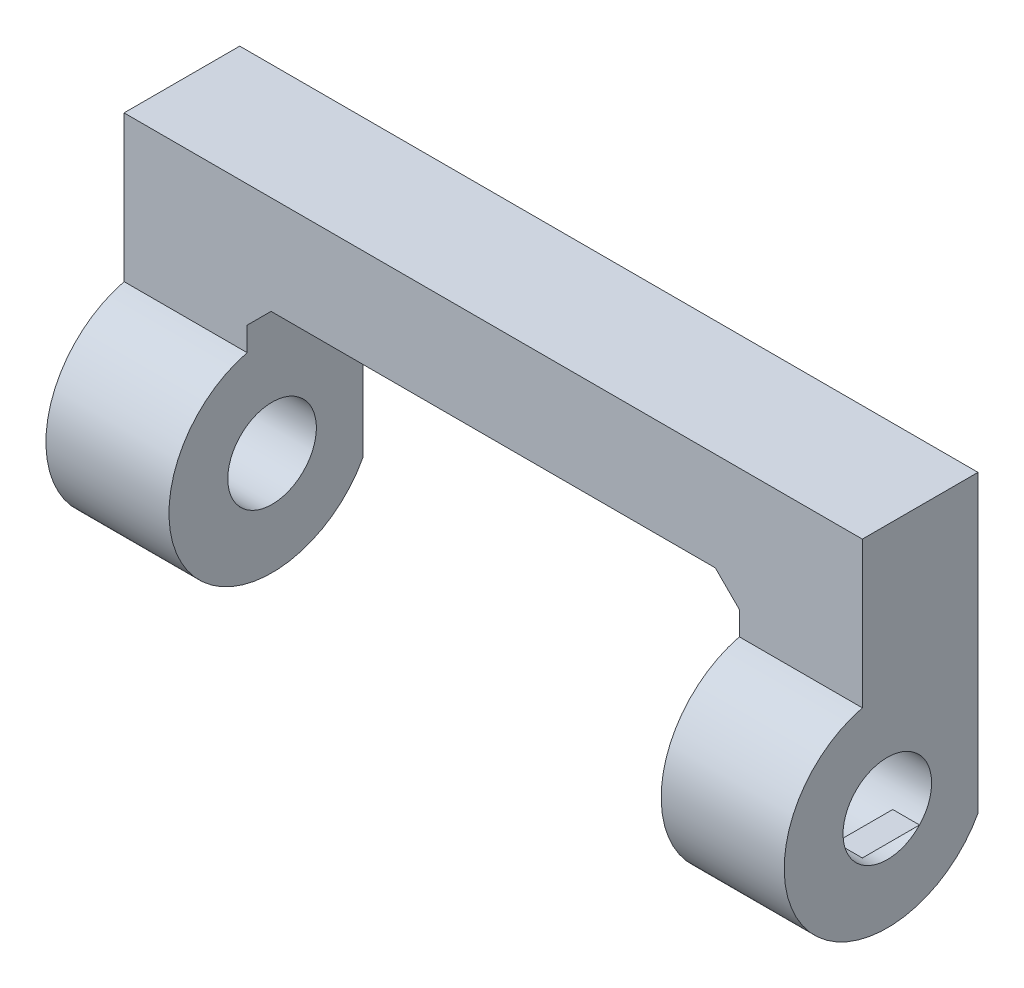
ISO-10303-21;
HEADER;
FILE_DESCRIPTION(('STEP AP214'),'2;1');
FILE_NAME('part.step','',(''),(''),'','','');
FILE_SCHEMA(('AUTOMOTIVE_DESIGN { 1 0 10303 214 1 1 1 1 }'));
ENDSEC;
DATA;
#1=APPLICATION_CONTEXT('core data for automotive mechanical design processes');
#2=APPLICATION_PROTOCOL_DEFINITION('international standard','automotive_design',2000,#1);
#3=PRODUCT_CONTEXT('',#1,'mechanical');
#4=PRODUCT('Part','Part','',(#3));
#5=PRODUCT_RELATED_PRODUCT_CATEGORY('part','',(#4));
#6=PRODUCT_DEFINITION_FORMATION('','',#4);
#7=PRODUCT_DEFINITION_CONTEXT('part definition',#1,'design');
#8=PRODUCT_DEFINITION('design','',#6,#7);
#9=PRODUCT_DEFINITION_SHAPE('','',#8);
#10=(LENGTH_UNIT() NAMED_UNIT(*) SI_UNIT(.MILLI.,.METRE.));
#11=(NAMED_UNIT(*) PLANE_ANGLE_UNIT() SI_UNIT($,.RADIAN.));
#12=(NAMED_UNIT(*) SI_UNIT($,.STERADIAN.) SOLID_ANGLE_UNIT());
#13=UNCERTAINTY_MEASURE_WITH_UNIT(LENGTH_MEASURE(1.E-05),#10,'distance_accuracy_value','');
#14=(GEOMETRIC_REPRESENTATION_CONTEXT(3) GLOBAL_UNCERTAINTY_ASSIGNED_CONTEXT((#13)) GLOBAL_UNIT_ASSIGNED_CONTEXT((#10,
#11,#12)) REPRESENTATION_CONTEXT('',''));
#15=CARTESIAN_POINT('',(0.,0.,0.));
#16=DIRECTION('',(0.,0.,1.));
#17=DIRECTION('',(1.,0.,0.));
#18=AXIS2_PLACEMENT_3D('',#15,#16,#17);
#19=CARTESIAN_POINT('',(0.00891092043960089,28.1178383359795,5.));
#20=DIRECTION('',(0.000316913408692528,0.999999949782944,0.));
#21=DIRECTION('',(-0.999999949782944,0.000316913408692528,0.));
#22=AXIS2_PLACEMENT_3D('',#19,#20,#21);
#23=PLANE('',#22);
#24=CARTESIAN_POINT('',(-3578.65020959207,29.2519634533622,3.98565749789785));
#25=DIRECTION('',(0.000316913408692528,0.999999949782944,0.));
#26=DIRECTION('',(-0.999999949782944,0.000316913408692528,0.));
#27=AXIS2_PLACEMENT_3D('',#24,#25,#26);
#28=ELLIPSE('',#27,5678.75808612486,1.7996745821636);
#29=CARTESIAN_POINT('',(319.6439887053,28.0165416888542,2.67700870408364));
#30=VERTEX_POINT('',#29);
#31=CARTESIAN_POINT('',(318.554795372569,28.0168868688433,2.67668375549989));
#32=VERTEX_POINT('',#31);
#33=EDGE_CURVE('E207',#30,#32,#28,.T.);
#34=ORIENTED_EDGE('',*,*,#33,.F.);
#35=DIRECTION('',(0.,0.,-1.));
#36=VECTOR('',#35,1.);
#37=CARTESIAN_POINT('',(319.6439887053,28.0165416888542,5.));
#38=LINE('',#37,#36);
#39=CARTESIAN_POINT('',(319.6439887053,28.0165416888542,5.));
#40=VERTEX_POINT('',#39);
#41=EDGE_CURVE('E240',#40,#30,#38,.T.);
#42=ORIENTED_EDGE('',*,*,#41,.F.);
#43=DIRECTION('',(0.999999949782944,-0.000316913408692528,0.));
#44=VECTOR('',#43,1.);
#45=CARTESIAN_POINT('',(0.00891092043960089,28.1178383359795,5.));
#46=LINE('',#45,#44);
#47=CARTESIAN_POINT('',(318.554795372563,28.0168868688433,5.));
#48=VERTEX_POINT('',#47);
#49=EDGE_CURVE('E212',#48,#40,#46,.T.);
#50=ORIENTED_EDGE('',*,*,#49,.F.);
#51=DIRECTION('',(0.,0.,-1.));
#52=VECTOR('',#51,1.);
#53=CARTESIAN_POINT('',(318.554795372569,28.0168868688433,5.));
#54=LINE('',#53,#52);
#55=EDGE_CURVE('E383',#48,#32,#54,.T.);
#56=ORIENTED_EDGE('',*,*,#55,.T.);
#57=EDGE_LOOP('',(#34,#42,#50,#56));
#58=FACE_BOUND('',#57,.T.);
#59=ADVANCED_FACE('F39',(#58),#23,.F.);
#60=CARTESIAN_POINT('',(0.,0.,5.));
#61=DIRECTION('',(0.,0.,1.));
#62=DIRECTION('',(1.,0.,0.));
#63=AXIS2_PLACEMENT_3D('',#60,#61,#62);
#64=PLANE('',#63);
#65=DIRECTION('',(-1.,0.,0.));
#66=VECTOR('',#65,1.);
#67=CARTESIAN_POINT('',(319.6439887053,28.0168868688433,5.));
#68=LINE('',#67,#66);
#69=CARTESIAN_POINT('',(319.6439887053,28.0168868688433,5.));
#70=VERTEX_POINT('',#69);
#71=EDGE_CURVE('E690',#70,#48,#68,.T.);
#72=ORIENTED_EDGE('',*,*,#71,.T.);
#73=ORIENTED_EDGE('',*,*,#49,.T.);
#74=DIRECTION('',(0.,-1.,0.));
#75=VECTOR('',#74,1.);
#76=CARTESIAN_POINT('',(319.6439887053,0.,5.));
#77=LINE('',#76,#75);
#78=EDGE_CURVE('E215',#70,#40,#77,.T.);
#79=ORIENTED_EDGE('',*,*,#78,.F.);
#80=EDGE_LOOP('',(#72,#73,#79));
#81=FACE_BOUND('',#80,.T.);
#82=ADVANCED_FACE('F428',(#81),#64,.T.);
#83=CARTESIAN_POINT('',(130.157955892487,-130.183347306878,5.));
#84=DIRECTION('',(-0.707037812810984,0.707175742835867,0.));
#85=DIRECTION('',(-0.707175742835867,-0.707037812810984,0.));
#86=AXIS2_PLACEMENT_3D('',#83,#84,#85);
#87=PLANE('',#86);
#88=DIRECTION('',(0.,0.,-1.));
#89=VECTOR('',#88,1.);
#90=CARTESIAN_POINT('',(294.639989597374,34.2666052481232,5.));
#91=LINE('',#90,#89);
#92=CARTESIAN_POINT('',(294.639989597374,34.2666052481232,5.));
#93=VERTEX_POINT('',#92);
#94=CARTESIAN_POINT('',(294.639989597374,34.2666052481232,0.300000000000019));
#95=VERTEX_POINT('',#94);
#96=EDGE_CURVE('E231',#93,#95,#91,.T.);
#97=ORIENTED_EDGE('',*,*,#96,.T.);
#98=DIRECTION('',(0.707175742835867,0.707037812810984,0.));
#99=VECTOR('',#98,1.);
#100=CARTESIAN_POINT('',(130.157955892487,-130.183347306878,0.300000000000025));
#101=LINE('',#100,#99);
#102=CARTESIAN_POINT('',(295.614474597472,35.240900181265,0.300000000000025));
#103=VERTEX_POINT('',#102);
#104=EDGE_CURVE('E282',#95,#103,#101,.T.);
#105=ORIENTED_EDGE('',*,*,#104,.T.);
#106=DIRECTION('',(0.,0.,-1.));
#107=VECTOR('',#106,1.);
#108=CARTESIAN_POINT('',(295.614474597472,35.240900181265,5.));
#109=LINE('',#108,#107);
#110=CARTESIAN_POINT('',(295.614474597472,35.240900181265,5.));
#111=VERTEX_POINT('',#110);
#112=EDGE_CURVE('E248',#111,#103,#109,.T.);
#113=ORIENTED_EDGE('',*,*,#112,.F.);
#114=DIRECTION('',(0.707175742835867,0.707037812810984,0.));
#115=VECTOR('',#114,1.);
#116=CARTESIAN_POINT('',(130.157955892487,-130.183347306878,5.));
#117=LINE('',#116,#115);
#118=EDGE_CURVE('E380',#93,#111,#117,.T.);
#119=ORIENTED_EDGE('',*,*,#118,.F.);
#120=EDGE_LOOP('',(#97,#105,#113,#119));
#121=FACE_BOUND('',#120,.T.);
#122=ADVANCED_FACE('F381',(#121),#87,.F.);
#123=CARTESIAN_POINT('',(0.00343618517108513,35.2697039001932,5.));
#124=DIRECTION('',(9.74259711536303E-05,0.99999999525409,0.));
#125=DIRECTION('',(-0.99999999525409,9.74259711536303E-05,0.));
#126=AXIS2_PLACEMENT_3D('',#123,#124,#125);
#127=PLANE('',#126);
#128=DIRECTION('',(0.99999999525409,-9.74259711536303E-05,0.));
#129=VECTOR('',#128,1.);
#130=CARTESIAN_POINT('',(0.00343618517108513,35.2697039001932,0.300000000000019));
#131=LINE('',#130,#129);
#132=CARTESIAN_POINT('',(304.640051212635,35.2400243819843,0.300000000000019));
#133=VERTEX_POINT('',#132);
#134=EDGE_CURVE('E278',#103,#133,#131,.T.);
#135=ORIENTED_EDGE('',*,*,#134,.T.);
#136=DIRECTION('',(0.99999999525409,-9.74259711536303E-05,0.));
#137=VECTOR('',#136,1.);
#138=CARTESIAN_POINT('',(0.00343618517108513,35.2697039001932,0.300000000000019));
#139=LINE('',#138,#137);
#140=CARTESIAN_POINT('',(313.667685024274,35.2391448559888,0.300000000000019));
#141=VERTEX_POINT('',#140);
#142=EDGE_CURVE('E280',#133,#141,#139,.T.);
#143=ORIENTED_EDGE('',*,*,#142,.T.);
#144=DIRECTION('',(0.,0.,-1.));
#145=VECTOR('',#144,1.);
#146=CARTESIAN_POINT('',(313.667685024274,35.2391448559888,5.));
#147=LINE('',#146,#145);
#148=CARTESIAN_POINT('',(313.667685024274,35.2391448559888,5.));
#149=VERTEX_POINT('',#148);
#150=EDGE_CURVE('E245',#149,#141,#147,.T.);
#151=ORIENTED_EDGE('',*,*,#150,.F.);
#152=DIRECTION('',(0.99999999525409,-9.74259711536303E-05,0.));
#153=VECTOR('',#152,1.);
#154=CARTESIAN_POINT('',(0.00343618517108513,35.2697039001932,5.));
#155=LINE('',#154,#153);
#156=CARTESIAN_POINT('',(304.640051212635,35.2400243819843,5.));
#157=VERTEX_POINT('',#156);
#158=EDGE_CURVE('E217',#157,#149,#155,.T.);
#159=ORIENTED_EDGE('',*,*,#158,.F.);
#160=DIRECTION('',(0.999999995292078,-9.70352714235132E-05,0.));
#161=VECTOR('',#160,1.);
#162=CARTESIAN_POINT('',(0.00342239375794619,35.2695848800865,5.));
#163=LINE('',#162,#161);
#164=EDGE_CURVE('E382',#111,#157,#163,.T.);
#165=ORIENTED_EDGE('',*,*,#164,.F.);
#166=ORIENTED_EDGE('',*,*,#112,.T.);
#167=EDGE_LOOP('',(#135,#143,#151,#159,#165,#166));
#168=FACE_BOUND('',#167,.T.);
#169=ADVANCED_FACE('F393',(#168),#127,.F.);
#170=CARTESIAN_POINT('',(174.160958512219,174.485995032664,5.));
#171=DIRECTION('',(-0.706447252798405,-0.707765694996294,0.));
#172=DIRECTION('',(0.707765694996294,-0.706447252798405,0.));
#173=AXIS2_PLACEMENT_3D('',#170,#171,#172);
#174=PLANE('',#173);
#175=ORIENTED_EDGE('',*,*,#150,.T.);
#176=DIRECTION('',(0.707765694996294,-0.706447252798405,0.));
#177=VECTOR('',#176,1.);
#178=CARTESIAN_POINT('',(314.6439887053,34.2646598558916,0.300000000000006));
#179=LINE('',#178,#177);
#180=CARTESIAN_POINT('',(314.6439887053,34.2646598558916,0.300000000000006));
#181=VERTEX_POINT('',#180);
#182=EDGE_CURVE('E276',#141,#181,#179,.T.);
#183=ORIENTED_EDGE('',*,*,#182,.T.);
#184=DIRECTION('',(0.,0.,-1.));
#185=VECTOR('',#184,1.);
#186=CARTESIAN_POINT('',(314.6439887053,34.2646598558916,5.));
#187=LINE('',#186,#185);
#188=CARTESIAN_POINT('',(314.6439887053,34.2646598558916,5.));
#189=VERTEX_POINT('',#188);
#190=EDGE_CURVE('E243',#189,#181,#187,.T.);
#191=ORIENTED_EDGE('',*,*,#190,.F.);
#192=DIRECTION('',(-0.707765694996294,0.706447252798405,0.));
#193=VECTOR('',#192,1.);
#194=CARTESIAN_POINT('',(174.160958512219,174.485995032664,5.));
#195=LINE('',#194,#193);
#196=EDGE_CURVE('E211',#189,#149,#195,.T.);
#197=ORIENTED_EDGE('',*,*,#196,.T.);
#198=EDGE_LOOP('',(#175,#183,#191,#197));
#199=FACE_BOUND('',#198,.T.);
#200=ADVANCED_FACE('F397',(#199),#174,.T.);
#201=CARTESIAN_POINT('',(314.643988705299,-2.7961508189543E-12,5.));
#202=DIRECTION('',(1.,0.,0.));
#203=DIRECTION('',(0.,1.,0.));
#204=AXIS2_PLACEMENT_3D('',#201,#202,#203);
#205=PLANE('',#204);
#206=ORIENTED_EDGE('',*,*,#190,.T.);
#207=DIRECTION('',(0.,-1.,0.));
#208=VECTOR('',#207,1.);
#209=CARTESIAN_POINT('',(314.643988705299,-2.7961508189543E-12,0.299999999999991));
#210=LINE('',#209,#208);
#211=CARTESIAN_POINT('',(314.6439887053,27.2420174168275,0.299999999999991));
#212=VERTEX_POINT('',#211);
#213=EDGE_CURVE('E193',#181,#212,#210,.T.);
#214=ORIENTED_EDGE('',*,*,#213,.T.);
#215=CARTESIAN_POINT('',(314.6439887053,29.2345980989651,3.98580689099696));
#216=DIRECTION('',(-1.,0.,0.));
#217=DIRECTION('',(0.,-1.,0.));
#218=AXIS2_PLACEMENT_3D('',#215,#216,#217);
#219=CIRCLE('',#218,4.18993439239193);
#220=CARTESIAN_POINT('',(314.6439887053,33.2999348070619,5.));
#221=VERTEX_POINT('',#220);
#222=EDGE_CURVE('E184',#212,#221,#219,.T.);
#223=ORIENTED_EDGE('',*,*,#222,.T.);
#224=DIRECTION('',(0.,-1.,0.));
#225=VECTOR('',#224,1.);
#226=CARTESIAN_POINT('',(314.643988705299,-2.7961508189543E-12,5.));
#227=LINE('',#226,#225);
#228=EDGE_CURVE('E190',#189,#221,#227,.T.);
#229=ORIENTED_EDGE('',*,*,#228,.F.);
#230=EDGE_LOOP('',(#206,#214,#223,#229));
#231=FACE_BOUND('',#230,.T.);
#232=CARTESIAN_POINT('',(314.6439887053,29.2519647947874,3.98565706253535));
#233=DIRECTION('',(1.,0.,0.));
#234=DIRECTION('',(0.,1.,0.));
#235=AXIS2_PLACEMENT_3D('',#232,#233,#234);
#236=CIRCLE('',#235,1.7996745821636);
#237=CARTESIAN_POINT('',(314.6439887053,31.051639376951,3.98565706253535));
#238=VERTEX_POINT('',#237);
#239=EDGE_CURVE('E387',#238,#238,#236,.T.);
#240=ORIENTED_EDGE('',*,*,#239,.T.);
#241=EDGE_LOOP('',(#240));
#242=FACE_BOUND('',#241,.T.);
#243=ADVANCED_FACE('F187',(#231,#242),#205,.F.);
#244=CARTESIAN_POINT('',(319.6439887053,0.,5.));
#245=DIRECTION('',(1.,0.,0.));
#246=DIRECTION('',(0.,0.,-1.));
#247=AXIS2_PLACEMENT_3D('',#244,#245,#246);
#248=PLANE('',#247);
#249=ORIENTED_EDGE('',*,*,#41,.T.);
#250=CARTESIAN_POINT('',(319.6439887053,29.2519647947874,3.98565706253535));
#251=DIRECTION('',(-1.,0.,0.));
#252=DIRECTION('',(0.,0.,1.));
#253=AXIS2_PLACEMENT_3D('',#250,#251,#252);
#254=CIRCLE('',#253,1.7996745821636);
#255=CARTESIAN_POINT('',(319.6439887053,28.0168868688433,2.67668375549989));
#256=VERTEX_POINT('',#255);
#257=EDGE_CURVE('E699',#30,#256,#254,.T.);
#258=ORIENTED_EDGE('',*,*,#257,.T.);
#259=DIRECTION('',(0.,0.,1.));
#260=VECTOR('',#259,1.);
#261=CARTESIAN_POINT('',(319.6439887053,28.0168868688433,0.));
#262=LINE('',#261,#260);
#263=EDGE_CURVE('E692',#256,#70,#262,.T.);
#264=ORIENTED_EDGE('',*,*,#263,.T.);
#265=ORIENTED_EDGE('',*,*,#78,.T.);
#266=EDGE_LOOP('',(#249,#258,#264,#265));
#267=FACE_BOUND('',#266,.T.);
#268=CARTESIAN_POINT('',(319.6439887053,29.234598098965,3.98580689099696));
#269=DIRECTION('',(-1.,0.,0.));
#270=DIRECTION('',(0.,-1.,0.));
#271=AXIS2_PLACEMENT_3D('',#268,#269,#270);
#272=CIRCLE('',#271,4.18993439239193);
#273=CARTESIAN_POINT('',(319.6439887053,27.2420174168274,0.300000000000005));
#274=VERTEX_POINT('',#273);
#275=CARTESIAN_POINT('',(319.6439887053,33.2999348070618,5.));
#276=VERTEX_POINT('',#275);
#277=EDGE_CURVE('E196',#274,#276,#272,.T.);
#278=ORIENTED_EDGE('',*,*,#277,.F.);
#279=DIRECTION('',(0.,1.,0.));
#280=VECTOR('',#279,1.);
#281=CARTESIAN_POINT('',(319.6439887053,39.2394456506574,0.300000000000005));
#282=LINE('',#281,#280);
#283=CARTESIAN_POINT('',(319.6439887053,39.2394456506574,0.300000000000005));
#284=VERTEX_POINT('',#283);
#285=EDGE_CURVE('E295',#274,#284,#282,.T.);
#286=ORIENTED_EDGE('',*,*,#285,.T.);
#287=DIRECTION('',(0.,0.,-1.));
#288=VECTOR('',#287,1.);
#289=CARTESIAN_POINT('',(319.6439887053,39.2394456506574,5.));
#290=LINE('',#289,#288);
#291=CARTESIAN_POINT('',(319.6439887053,39.2394456506574,5.));
#292=VERTEX_POINT('',#291);
#293=EDGE_CURVE('E237',#292,#284,#290,.T.);
#294=ORIENTED_EDGE('',*,*,#293,.F.);
#295=EDGE_CURVE('E221',#292,#276,#77,.T.);
#296=ORIENTED_EDGE('',*,*,#295,.T.);
#297=EDGE_LOOP('',(#278,#286,#294,#296));
#298=FACE_BOUND('',#297,.T.);
#299=ADVANCED_FACE('F347',(#267,#298),#248,.T.);
#300=CARTESIAN_POINT('',(-2.77032489532945E-05,39.2392199790521,5.));
#301=DIRECTION('',(-7.06009165525639E-07,0.999999999999751,0.));
#302=DIRECTION('',(-0.999999999999751,-7.06009165525639E-07,0.));
#303=AXIS2_PLACEMENT_3D('',#300,#301,#302);
#304=PLANE('',#303);
#305=ORIENTED_EDGE('',*,*,#293,.T.);
#306=DIRECTION('',(-0.999999999999751,-7.06009165525639E-07,0.));
#307=VECTOR('',#306,1.);
#308=CARTESIAN_POINT('',(289.639989597374,39.239424467559,0.300000000000005));
#309=LINE('',#308,#307);
#310=CARTESIAN_POINT('',(289.639989597374,39.239424467559,0.300000000000005));
#311=VERTEX_POINT('',#310);
#312=EDGE_CURVE('E293',#284,#311,#309,.T.);
#313=ORIENTED_EDGE('',*,*,#312,.T.);
#314=DIRECTION('',(0.,0.,-1.));
#315=VECTOR('',#314,1.);
#316=CARTESIAN_POINT('',(289.639989597374,39.239424467559,5.));
#317=LINE('',#316,#315);
#318=CARTESIAN_POINT('',(289.639989597374,39.239424467559,5.));
#319=VERTEX_POINT('',#318);
#320=EDGE_CURVE('E234',#319,#311,#317,.T.);
#321=ORIENTED_EDGE('',*,*,#320,.F.);
#322=DIRECTION('',(0.999999999999751,7.06009165525639E-07,0.));
#323=VECTOR('',#322,1.);
#324=CARTESIAN_POINT('',(-2.77032489532945E-05,39.2392199790521,5.));
#325=LINE('',#324,#323);
#326=EDGE_CURVE('E223',#319,#292,#325,.T.);
#327=ORIENTED_EDGE('',*,*,#326,.T.);
#328=EDGE_LOOP('',(#305,#313,#321,#327));
#329=FACE_BOUND('',#328,.T.);
#330=ADVANCED_FACE('F355',(#329),#304,.T.);
#331=CARTESIAN_POINT('',(289.639989597374,0.,5.));
#332=DIRECTION('',(1.,0.,0.));
#333=DIRECTION('',(0.,0.,-1.));
#334=AXIS2_PLACEMENT_3D('',#331,#332,#333);
#335=PLANE('',#334);
#336=ORIENTED_EDGE('',*,*,#320,.T.);
#337=DIRECTION('',(0.,-1.,0.));
#338=VECTOR('',#337,1.);
#339=CARTESIAN_POINT('',(289.639989597374,0.,0.300000000000005));
#340=LINE('',#339,#338);
#341=CARTESIAN_POINT('',(289.639989597374,27.242017952969,0.300000000000005));
#342=VERTEX_POINT('',#341);
#343=EDGE_CURVE('E290',#311,#342,#340,.T.);
#344=ORIENTED_EDGE('',*,*,#343,.T.);
#345=CARTESIAN_POINT('',(289.639989597374,29.2345994404249,3.98580645563446));
#346=DIRECTION('',(-1.,0.,0.));
#347=DIRECTION('',(0.,-1.,0.));
#348=AXIS2_PLACEMENT_3D('',#345,#346,#347);
#349=CIRCLE('',#348,4.18993439239193);
#350=CARTESIAN_POINT('',(289.639989597374,33.2999360399104,5.));
#351=VERTEX_POINT('',#350);
#352=EDGE_CURVE('E206',#342,#351,#349,.T.);
#353=ORIENTED_EDGE('',*,*,#352,.T.);
#354=DIRECTION('',(0.,-1.,0.));
#355=VECTOR('',#354,1.);
#356=CARTESIAN_POINT('',(289.639989597374,0.,5.));
#357=LINE('',#356,#355);
#358=EDGE_CURVE('E226',#319,#351,#357,.T.);
#359=ORIENTED_EDGE('',*,*,#358,.F.);
#360=EDGE_LOOP('',(#336,#344,#353,#359));
#361=FACE_BOUND('',#360,.T.);
#362=CARTESIAN_POINT('',(289.639989597374,29.2519647947874,3.98565706253535));
#363=DIRECTION('',(-1.,0.,0.));
#364=DIRECTION('',(0.,0.,1.));
#365=AXIS2_PLACEMENT_3D('',#362,#363,#364);
#366=CIRCLE('',#365,1.7996745821636);
#367=CARTESIAN_POINT('',(289.639989597374,29.2519647947874,5.78533164469895));
#368=VERTEX_POINT('',#367);
#369=EDGE_CURVE('E368',#368,#368,#366,.T.);
#370=ORIENTED_EDGE('',*,*,#369,.F.);
#371=EDGE_LOOP('',(#370));
#372=FACE_BOUND('',#371,.T.);
#373=ADVANCED_FACE('F358',(#361,#372),#335,.F.);
#374=CARTESIAN_POINT('',(294.639989597374,0.,5.));
#375=DIRECTION('',(-1.,0.,0.));
#376=DIRECTION('',(0.,0.,1.));
#377=AXIS2_PLACEMENT_3D('',#374,#375,#376);
#378=PLANE('',#377);
#379=CARTESIAN_POINT('',(294.639989597374,29.2345994404249,3.98580645563446));
#380=DIRECTION('',(-1.,0.,0.));
#381=DIRECTION('',(0.,-1.,0.));
#382=AXIS2_PLACEMENT_3D('',#379,#380,#381);
#383=CIRCLE('',#382,4.18993439239193);
#384=CARTESIAN_POINT('',(294.639989597374,27.242017952969,0.300000000000018));
#385=VERTEX_POINT('',#384);
#386=CARTESIAN_POINT('',(294.639989597374,33.2999360399104,5.));
#387=VERTEX_POINT('',#386);
#388=EDGE_CURVE('E369',#385,#387,#383,.T.);
#389=ORIENTED_EDGE('',*,*,#388,.F.);
#390=DIRECTION('',(0.,1.,0.));
#391=VECTOR('',#390,1.);
#392=CARTESIAN_POINT('',(294.639989597374,0.,0.300000000000019));
#393=LINE('',#392,#391);
#394=EDGE_CURVE('E284',#385,#95,#393,.T.);
#395=ORIENTED_EDGE('',*,*,#394,.T.);
#396=ORIENTED_EDGE('',*,*,#96,.F.);
#397=DIRECTION('',(0.,1.,0.));
#398=VECTOR('',#397,1.);
#399=CARTESIAN_POINT('',(294.639989597374,0.,5.));
#400=LINE('',#399,#398);
#401=EDGE_CURVE('E229',#387,#93,#400,.T.);
#402=ORIENTED_EDGE('',*,*,#401,.F.);
#403=EDGE_LOOP('',(#389,#395,#396,#402));
#404=FACE_BOUND('',#403,.T.);
#405=CARTESIAN_POINT('',(294.639989597374,29.2519647947874,3.98565706253535));
#406=DIRECTION('',(-1.,0.,0.));
#407=DIRECTION('',(0.,0.,1.));
#408=AXIS2_PLACEMENT_3D('',#405,#406,#407);
#409=CIRCLE('',#408,1.7996745821636);
#410=CARTESIAN_POINT('',(294.639989597374,29.2519647947874,5.78533164469895));
#411=VERTEX_POINT('',#410);
#412=EDGE_CURVE('E696',#411,#411,#409,.T.);
#413=ORIENTED_EDGE('',*,*,#412,.T.);
#414=EDGE_LOOP('',(#413));
#415=FACE_BOUND('',#414,.T.);
#416=ADVANCED_FACE('F373',(#404,#415),#378,.F.);
#417=DIRECTION('',(-1.,0.,0.));
#418=VECTOR('',#417,1.);
#419=CARTESIAN_POINT('',(319.6439887053,33.2999348070618,5.));
#420=LINE('',#419,#418);
#421=EDGE_CURVE('E200',#276,#221,#420,.T.);
#422=ORIENTED_EDGE('',*,*,#421,.F.);
#423=ORIENTED_EDGE('',*,*,#295,.F.);
#424=ORIENTED_EDGE('',*,*,#326,.F.);
#425=ORIENTED_EDGE('',*,*,#358,.T.);
#426=DIRECTION('',(-1.,0.,0.));
#427=VECTOR('',#426,1.);
#428=CARTESIAN_POINT('',(294.639989597374,33.2999360399104,5.));
#429=LINE('',#428,#427);
#430=EDGE_CURVE('E364',#387,#351,#429,.T.);
#431=ORIENTED_EDGE('',*,*,#430,.F.);
#432=ORIENTED_EDGE('',*,*,#401,.T.);
#433=ORIENTED_EDGE('',*,*,#118,.T.);
#434=ORIENTED_EDGE('',*,*,#164,.T.);
#435=ORIENTED_EDGE('',*,*,#158,.T.);
#436=ORIENTED_EDGE('',*,*,#196,.F.);
#437=ORIENTED_EDGE('',*,*,#228,.T.);
#438=EDGE_LOOP('',(#422,#423,#424,#425,#431,#432,#433,#434,#435,#436,#437));
#439=FACE_BOUND('',#438,.T.);
#440=ADVANCED_FACE('F209',(#439),#64,.T.);
#441=CARTESIAN_POINT('',(0.,0.,0.));
#442=DIRECTION('',(0.,0.,1.));
#443=DIRECTION('',(1.,0.,0.));
#444=AXIS2_PLACEMENT_3D('',#441,#442,#443);
#445=PLANE('',#444);
#446=DIRECTION('',(0.,-1.,0.));
#447=VECTOR('',#446,1.);
#448=CARTESIAN_POINT('',(319.3439887053,27.9427400917632,0.));
#449=LINE('',#448,#447);
#450=CARTESIAN_POINT('',(319.3439887053,38.9394454388545,0.));
#451=VERTEX_POINT('',#450);
#452=CARTESIAN_POINT('',(319.3439887053,28.0075725739192,0.));
#453=VERTEX_POINT('',#452);
#454=EDGE_CURVE('E256',#451,#453,#449,.T.);
#455=ORIENTED_EDGE('',*,*,#454,.T.);
#456=DIRECTION('',(1.,0.,0.));
#457=VECTOR('',#456,1.);
#458=CARTESIAN_POINT('',(314.943988705299,28.0075725739193,0.));
#459=LINE('',#458,#457);
#460=CARTESIAN_POINT('',(314.943988705299,28.0075725739193,0.));
#461=VERTEX_POINT('',#460);
#462=EDGE_CURVE('E320',#453,#461,#459,.F.);
#463=ORIENTED_EDGE('',*,*,#462,.T.);
#464=DIRECTION('',(0.,1.,0.));
#465=VECTOR('',#464,1.);
#466=CARTESIAN_POINT('',(314.943988705299,-2.79881683284873E-12,0.));
#467=LINE('',#466,#465);
#468=CARTESIAN_POINT('',(314.9439887053,34.3890877912706,0.));
#469=VERTEX_POINT('',#468);
#470=EDGE_CURVE('E274',#461,#469,#467,.T.);
#471=ORIENTED_EDGE('',*,*,#470,.T.);
#472=DIRECTION('',(-0.707765694996294,0.706447252798405,0.));
#473=VECTOR('',#472,1.);
#474=CARTESIAN_POINT('',(313.879619200114,35.4514745644878,0.));
#475=LINE('',#474,#473);
#476=CARTESIAN_POINT('',(313.791797402496,35.5391327656436,0.));
#477=VERTEX_POINT('',#476);
#478=EDGE_CURVE('E272',#469,#477,#475,.T.);
#479=ORIENTED_EDGE('',*,*,#478,.T.);
#480=DIRECTION('',(-0.99999999525409,9.74259711536303E-05,0.));
#481=VECTOR('',#480,1.);
#482=CARTESIAN_POINT('',(0.00346541296243122,35.5697038987695,0.));
#483=LINE('',#482,#481);
#484=CARTESIAN_POINT('',(304.640080440426,35.5400243805606,0.));
#485=VERTEX_POINT('',#484);
#486=EDGE_CURVE('E270',#477,#485,#483,.T.);
#487=ORIENTED_EDGE('',*,*,#486,.T.);
#488=DIRECTION('',(-0.99999999525409,9.74259711536303E-05,0.));
#489=VECTOR('',#488,1.);
#490=CARTESIAN_POINT('',(0.00346541296243122,35.5697038987695,0.));
#491=LINE('',#490,#489);
#492=CARTESIAN_POINT('',(295.490243302278,35.5409158123339,0.));
#493=VERTEX_POINT('',#492);
#494=EDGE_CURVE('E268',#485,#493,#491,.T.);
#495=ORIENTED_EDGE('',*,*,#494,.T.);
#496=DIRECTION('',(-0.707175742835867,-0.707037812810984,0.));
#497=VECTOR('',#496,1.);
#498=CARTESIAN_POINT('',(129.945844548644,-129.971194584027,0.));
#499=LINE('',#498,#497);
#500=CARTESIAN_POINT('',(294.339989597374,34.3908864569274,0.));
#501=VERTEX_POINT('',#500);
#502=EDGE_CURVE('E266',#493,#501,#499,.T.);
#503=ORIENTED_EDGE('',*,*,#502,.T.);
#504=DIRECTION('',(0.,-1.,0.));
#505=VECTOR('',#504,1.);
#506=CARTESIAN_POINT('',(294.339989597374,0.,0.));
#507=LINE('',#506,#505);
#508=CARTESIAN_POINT('',(294.339989597374,28.0075726430951,0.));
#509=VERTEX_POINT('',#508);
#510=EDGE_CURVE('E263',#501,#509,#507,.T.);
#511=ORIENTED_EDGE('',*,*,#510,.T.);
#512=DIRECTION('',(1.,0.,0.));
#513=VECTOR('',#512,1.);
#514=CARTESIAN_POINT('',(289.939989597374,28.0075726430951,0.));
#515=LINE('',#514,#513);
#516=CARTESIAN_POINT('',(289.939989597374,28.0075726430951,0.));
#517=VERTEX_POINT('',#516);
#518=EDGE_CURVE('E297',#509,#517,#515,.F.);
#519=ORIENTED_EDGE('',*,*,#518,.T.);
#520=DIRECTION('',(0.,1.,0.));
#521=VECTOR('',#520,1.);
#522=CARTESIAN_POINT('',(289.939989597374,0.,0.));
#523=LINE('',#522,#521);
#524=CARTESIAN_POINT('',(289.939989597374,38.9394246793617,0.));
#525=VERTEX_POINT('',#524);
#526=EDGE_CURVE('E261',#517,#525,#523,.T.);
#527=ORIENTED_EDGE('',*,*,#526,.T.);
#528=DIRECTION('',(0.999999999999751,7.06009165525639E-07,0.));
#529=VECTOR('',#528,1.);
#530=CARTESIAN_POINT('',(319.643988917102,38.9394456506574,0.));
#531=LINE('',#530,#529);
#532=EDGE_CURVE('E259',#525,#451,#531,.T.);
#533=ORIENTED_EDGE('',*,*,#532,.T.);
#534=EDGE_LOOP('',(#455,#463,#471,#479,#487,#495,#503,#511,#519,#527,#533));
#535=FACE_BOUND('',#534,.T.);
#536=ADVANCED_FACE('F340',(#535),#445,.F.);
#537=CARTESIAN_POINT('',(319.6439887053,29.2519647947874,3.98565706253535));
#538=DIRECTION('',(-1.,0.,0.));
#539=DIRECTION('',(0.,-1.,0.));
#540=AXIS2_PLACEMENT_3D('',#537,#538,#539);
#541=CYLINDRICAL_SURFACE('',#540,1.7996745821636);
#542=ORIENTED_EDGE('',*,*,#369,.T.);
#543=EDGE_LOOP('',(#542));
#544=FACE_BOUND('',#543,.T.);
#545=ORIENTED_EDGE('',*,*,#412,.F.);
#546=EDGE_LOOP('',(#545));
#547=FACE_BOUND('',#546,.T.);
#548=ADVANCED_FACE('F573',(#544,#547),#541,.F.);
#549=CARTESIAN_POINT('',(319.6439887053,28.0168868688433,0.));
#550=DIRECTION('',(0.,-1.,0.));
#551=DIRECTION('',(1.,0.,0.));
#552=AXIS2_PLACEMENT_3D('',#549,#550,#551);
#553=PLANE('',#552);
#554=ORIENTED_EDGE('',*,*,#71,.F.);
#555=ORIENTED_EDGE('',*,*,#263,.F.);
#556=DIRECTION('',(-1.,0.,0.));
#557=VECTOR('',#556,1.);
#558=CARTESIAN_POINT('',(319.6439887053,28.0168868688433,2.67668375549989));
#559=LINE('',#558,#557);
#560=EDGE_CURVE('E697',#256,#32,#559,.T.);
#561=ORIENTED_EDGE('',*,*,#560,.T.);
#562=ORIENTED_EDGE('',*,*,#55,.F.);
#563=EDGE_LOOP('',(#554,#555,#561,#562));
#564=FACE_BOUND('',#563,.T.);
#565=ADVANCED_FACE('F570',(#564),#553,.F.);
#566=ORIENTED_EDGE('',*,*,#239,.F.);
#567=EDGE_LOOP('',(#566));
#568=FACE_BOUND('',#567,.T.);
#569=ORIENTED_EDGE('',*,*,#33,.T.);
#570=ORIENTED_EDGE('',*,*,#560,.F.);
#571=ORIENTED_EDGE('',*,*,#257,.F.);
#572=EDGE_LOOP('',(#569,#570,#571));
#573=FACE_BOUND('',#572,.T.);
#574=ADVANCED_FACE('F563',(#568,#573),#541,.F.);
#575=CARTESIAN_POINT('',(294.639989597374,29.2345994404249,3.98580645563446));
#576=DIRECTION('',(-1.,0.,0.));
#577=DIRECTION('',(0.,-1.,0.));
#578=AXIS2_PLACEMENT_3D('',#575,#576,#577);
#579=CYLINDRICAL_SURFACE('',#578,4.18993439239193);
#580=CARTESIAN_POINT('',(285.95418314174,29.2345994404249,3.98580645563446));
#581=DIRECTION('',(0.707106781186527,0.,0.707106781186568));
#582=DIRECTION('',(-0.707106781186568,0.,0.707106781186527));
#583=AXIS2_PLACEMENT_3D('',#580,#581,#582);
#584=ELLIPSE('',#583,5.92546204317431,4.18993439239193);
#585=CARTESIAN_POINT('',(289.91844537886,27.8780688923397,0.0215442185138859));
#586=VERTEX_POINT('',#585);
#587=EDGE_CURVE('E286',#342,#586,#584,.T.);
#588=ORIENTED_EDGE('',*,*,#587,.T.);
#589=DIRECTION('',(-1.,0.,0.));
#590=VECTOR('',#589,1.);
#591=CARTESIAN_POINT('',(294.639989597374,27.8780688923397,0.0215442185138876));
#592=LINE('',#591,#590);
#593=CARTESIAN_POINT('',(294.361533815888,27.8780688923397,0.0215442185138894));
#594=VERTEX_POINT('',#593);
#595=EDGE_CURVE('E47',#586,#594,#592,.F.);
#596=ORIENTED_EDGE('',*,*,#595,.T.);
#597=CARTESIAN_POINT('',(298.325796053009,29.2345994404249,3.98580645563446));
#598=DIRECTION('',(-0.707106781186543,0.,0.707106781186552));
#599=DIRECTION('',(-0.707106781186552,0.,-0.707106781186543));
#600=AXIS2_PLACEMENT_3D('',#597,#598,#599);
#601=ELLIPSE('',#600,5.92546204317418,4.18993439239193);
#602=EDGE_CURVE('E288',#594,#385,#601,.T.);
#603=ORIENTED_EDGE('',*,*,#602,.T.);
#604=ORIENTED_EDGE('',*,*,#388,.T.);
#605=ORIENTED_EDGE('',*,*,#430,.T.);
#606=ORIENTED_EDGE('',*,*,#352,.F.);
#607=EDGE_LOOP('',(#588,#596,#603,#604,#605,#606));
#608=FACE_BOUND('',#607,.T.);
#609=ADVANCED_FACE('F559',(#608),#579,.T.);
#610=CARTESIAN_POINT('',(319.6439887053,29.234598098965,3.98580689099696));
#611=DIRECTION('',(-1.,0.,0.));
#612=DIRECTION('',(0.,-1.,0.));
#613=AXIS2_PLACEMENT_3D('',#610,#611,#612);
#614=CYLINDRICAL_SURFACE('',#613,4.18993439239193);
#615=CARTESIAN_POINT('',(310.958181814302,29.2345980989651,3.98580689099696));
#616=DIRECTION('',(0.707106781186511,0.,0.707106781186584));
#617=DIRECTION('',(-0.707106781186584,0.,0.707106781186511));
#618=AXIS2_PLACEMENT_3D('',#615,#616,#617);
#619=ELLIPSE('',#618,5.92546204317445,4.18993439239193);
#620=CARTESIAN_POINT('',(314.922444532735,27.8780689574441,0.0215441725645443));
#621=VERTEX_POINT('',#620);
#622=EDGE_CURVE('E254',#212,#621,#619,.T.);
#623=ORIENTED_EDGE('',*,*,#622,.T.);
#624=DIRECTION('',(-1.,0.,0.));
#625=VECTOR('',#624,1.);
#626=CARTESIAN_POINT('',(319.6439887053,27.8780689574441,0.0215441725645426));
#627=LINE('',#626,#625);
#628=CARTESIAN_POINT('',(319.365532877864,27.8780689574441,0.0215441725645444));
#629=VERTEX_POINT('',#628);
#630=EDGE_CURVE('E325',#621,#629,#627,.F.);
#631=ORIENTED_EDGE('',*,*,#630,.T.);
#632=CARTESIAN_POINT('',(323.329795596297,29.234598098965,3.98580689099696));
#633=DIRECTION('',(0.707106781186527,0.,-0.707106781186568));
#634=DIRECTION('',(-0.707106781186568,0.,-0.707106781186527));
#635=AXIS2_PLACEMENT_3D('',#632,#633,#634);
#636=ELLIPSE('',#635,5.92546204317431,4.18993439239193);
#637=EDGE_CURVE('E252',#629,#274,#636,.F.);
#638=ORIENTED_EDGE('',*,*,#637,.T.);
#639=ORIENTED_EDGE('',*,*,#277,.T.);
#640=ORIENTED_EDGE('',*,*,#421,.T.);
#641=ORIENTED_EDGE('',*,*,#222,.F.);
#642=EDGE_LOOP('',(#623,#631,#638,#639,#640,#641));
#643=FACE_BOUND('',#642,.T.);
#644=ADVANCED_FACE('F201',(#643),#614,.T.);
#645=CARTESIAN_POINT('',(294.639989597374,0.,0.300000000000019));
#646=DIRECTION('',(-0.707106781186543,0.,0.707106781186552));
#647=DIRECTION('',(0.,1.,0.));
#648=AXIS2_PLACEMENT_3D('',#645,#646,#647);
#649=PLANE('',#648);
#650=ORIENTED_EDGE('',*,*,#602,.F.);
#651=CARTESIAN_POINT('',(294.739989597374,28.0075726430951,0.4));
#652=DIRECTION('',(-0.707106781186543,0.,0.707106781186552));
#653=DIRECTION('',(-0.707106781186552,0.,-0.707106781186543));
#654=AXIS2_PLACEMENT_3D('',#651,#652,#653);
#655=ELLIPSE('',#654,0.565685424949241,0.4);
#656=EDGE_CURVE('E11',#594,#509,#655,.F.);
#657=ORIENTED_EDGE('',*,*,#656,.T.);
#658=ORIENTED_EDGE('',*,*,#510,.F.);
#659=DIRECTION('',(0.678590948877022,-0.281120344700233,0.678590948877014));
#660=VECTOR('',#659,1.);
#661=CARTESIAN_POINT('',(250.269782976747,52.6478816271453,-44.0702066206272));
#662=LINE('',#661,#660);
#663=EDGE_CURVE('E197',#95,#501,#662,.F.);
#664=ORIENTED_EDGE('',*,*,#663,.F.);
#665=ORIENTED_EDGE('',*,*,#394,.F.);
#666=EDGE_LOOP('',(#650,#657,#658,#664,#665));
#667=FACE_BOUND('',#666,.T.);
#668=ADVANCED_FACE('F418',(#667),#649,.F.);
#669=CARTESIAN_POINT('',(130.157955892487,-130.183347306878,0.300000000000019));
#670=DIRECTION('',(-0.499951231993956,0.50004876324988,0.707106781186541));
#671=DIRECTION('',(0.707175742835867,0.707037812810984,0.));
#672=AXIS2_PLACEMENT_3D('',#669,#670,#671);
#673=PLANE('',#672);
#674=ORIENTED_EDGE('',*,*,#663,.T.);
#675=ORIENTED_EDGE('',*,*,#502,.F.);
#676=DIRECTION('',(0.281018484731808,-0.678625734248369,0.678598352528873));
#677=VECTOR('',#676,1.);
#678=CARTESIAN_POINT('',(272.264171228695,91.6290775205671,-56.0858986194149));
#679=LINE('',#678,#677);
#680=EDGE_CURVE('E308',#103,#493,#679,.F.);
#681=ORIENTED_EDGE('',*,*,#680,.F.);
#682=ORIENTED_EDGE('',*,*,#104,.F.);
#683=EDGE_LOOP('',(#674,#675,#681,#682));
#684=FACE_BOUND('',#683,.T.);
#685=ADVANCED_FACE('F415',(#684),#673,.F.);
#686=CARTESIAN_POINT('',(0.00343618517108513,35.2697039001932,0.300000000000019));
#687=DIRECTION('',(6.88905648664163E-05,0.707106777830676,0.707106781186554));
#688=DIRECTION('',(0.99999999525409,-9.74259711536303E-05,0.));
#689=AXIS2_PLACEMENT_3D('',#686,#687,#688);
#690=PLANE('',#689);
#691=ORIENTED_EDGE('',*,*,#680,.T.);
#692=ORIENTED_EDGE('',*,*,#494,.F.);
#693=DIRECTION('',(6.88905648846724E-05,0.707106777830689,-0.707106781186541));
#694=VECTOR('',#693,1.);
#695=CARTESIAN_POINT('',(304.640051212635,35.2400243819843,0.300000000000019));
#696=LINE('',#695,#694);
#697=EDGE_CURVE('E305',#133,#485,#696,.T.);
#698=ORIENTED_EDGE('',*,*,#697,.F.);
#699=ORIENTED_EDGE('',*,*,#134,.F.);
#700=EDGE_LOOP('',(#691,#692,#698,#699));
#701=FACE_BOUND('',#700,.T.);
#702=ADVANCED_FACE('F410',(#701),#690,.F.);
#703=CARTESIAN_POINT('',(0.00343618517108513,35.2697039001932,0.300000000000019));
#704=DIRECTION('',(6.88905648664163E-05,0.707106777830676,0.707106781186554));
#705=DIRECTION('',(0.99999999525409,-9.74259711536303E-05,0.));
#706=AXIS2_PLACEMENT_3D('',#703,#704,#705);
#707=PLANE('',#706);
#708=ORIENTED_EDGE('',*,*,#697,.T.);
#709=ORIENTED_EDGE('',*,*,#486,.F.);
#710=DIRECTION('',(0.280773790309246,0.678649008646665,-0.67867636008504));
#711=VECTOR('',#710,1.);
#712=CARTESIAN_POINT('',(329.317204735441,73.0650794850095,-37.5274591191574));
#713=LINE('',#712,#711);
#714=EDGE_CURVE('E301',#141,#477,#713,.T.);
#715=ORIENTED_EDGE('',*,*,#714,.F.);
#716=ORIENTED_EDGE('',*,*,#142,.F.);
#717=EDGE_LOOP('',(#708,#709,#715,#716));
#718=FACE_BOUND('',#717,.T.);
#719=ADVANCED_FACE('F406',(#718),#707,.F.);
#720=CARTESIAN_POINT('',(174.372892688059,174.698324741163,0.));
#721=DIRECTION('',(-0.499533643004332,-0.500465922423062,-0.707106781186586));
#722=DIRECTION('',(0.707765694996294,-0.706447252798405,0.));
#723=AXIS2_PLACEMENT_3D('',#720,#721,#722);
#724=PLANE('',#723);
#725=ORIENTED_EDGE('',*,*,#714,.T.);
#726=ORIENTED_EDGE('',*,*,#478,.F.);
#727=DIRECTION('',(0.67852760693068,0.281425964093484,-0.678527606930607));
#728=VECTOR('',#727,1.);
#729=CARTESIAN_POINT('',(308.100970784726,31.550879152542,6.84301792057316));
#730=LINE('',#729,#728);
#731=EDGE_CURVE('E298',#181,#469,#730,.T.);
#732=ORIENTED_EDGE('',*,*,#731,.F.);
#733=ORIENTED_EDGE('',*,*,#182,.F.);
#734=EDGE_LOOP('',(#725,#726,#732,#733));
#735=FACE_BOUND('',#734,.T.);
#736=ADVANCED_FACE('F402',(#735),#724,.T.);
#737=CARTESIAN_POINT('',(314.643988705299,-2.7961508189543E-12,0.299999999999991));
#738=DIRECTION('',(0.707106781186511,0.,0.707106781186584));
#739=DIRECTION('',(0.,-1.,0.));
#740=AXIS2_PLACEMENT_3D('',#737,#738,#739);
#741=PLANE('',#740);
#742=ORIENTED_EDGE('',*,*,#470,.F.);
#743=CARTESIAN_POINT('',(314.543988705299,28.0075725739193,0.4));
#744=DIRECTION('',(0.707106781186511,0.,0.707106781186584));
#745=DIRECTION('',(-0.707106781186584,0.,0.707106781186511));
#746=AXIS2_PLACEMENT_3D('',#743,#744,#745);
#747=ELLIPSE('',#746,0.565685424949268,0.4);
#748=EDGE_CURVE('E323',#461,#621,#747,.F.);
#749=ORIENTED_EDGE('',*,*,#748,.T.);
#750=ORIENTED_EDGE('',*,*,#622,.F.);
#751=ORIENTED_EDGE('',*,*,#213,.F.);
#752=ORIENTED_EDGE('',*,*,#731,.T.);
#753=EDGE_LOOP('',(#742,#749,#750,#751,#752));
#754=FACE_BOUND('',#753,.T.);
#755=ADVANCED_FACE('F345',(#754),#741,.F.);
#756=CARTESIAN_POINT('',(319.3439887053,0.,0.));
#757=DIRECTION('',(0.707106781186527,0.,-0.707106781186568));
#758=DIRECTION('',(0.,1.,0.));
#759=AXIS2_PLACEMENT_3D('',#756,#757,#758);
#760=PLANE('',#759);
#761=ORIENTED_EDGE('',*,*,#637,.F.);
#762=CARTESIAN_POINT('',(319.7439887053,28.0075725739192,0.4));
#763=DIRECTION('',(0.707106781186527,0.,-0.707106781186568));
#764=DIRECTION('',(-0.707106781186568,0.,-0.707106781186527));
#765=AXIS2_PLACEMENT_3D('',#762,#763,#764);
#766=ELLIPSE('',#765,0.565685424949254,0.4);
#767=EDGE_CURVE('E327',#629,#453,#766,.T.);
#768=ORIENTED_EDGE('',*,*,#767,.T.);
#769=ORIENTED_EDGE('',*,*,#454,.F.);
#770=DIRECTION('',(0.577350133318058,0.577350540932698,0.577350133318025));
#771=VECTOR('',#770,1.);
#772=CARTESIAN_POINT('',(306.364170504394,25.9596180740747,-12.979818200905));
#773=LINE('',#772,#771);
#774=EDGE_CURVE('E302',#284,#451,#773,.F.);
#775=ORIENTED_EDGE('',*,*,#774,.F.);
#776=ORIENTED_EDGE('',*,*,#285,.F.);
#777=EDGE_LOOP('',(#761,#768,#769,#775,#776));
#778=FACE_BOUND('',#777,.T.);
#779=ADVANCED_FACE('F333',(#778),#760,.T.);
#780=CARTESIAN_POINT('',(-2.74914462036368E-05,38.9392199790521,0.));
#781=DIRECTION('',(-4.99223868523016E-07,0.707106781186345,-0.707106781186574));
#782=DIRECTION('',(-0.999999999999751,-7.06009165525639E-07,0.));
#783=AXIS2_PLACEMENT_3D('',#780,#781,#782);
#784=PLANE('',#783);
#785=ORIENTED_EDGE('',*,*,#774,.T.);
#786=ORIENTED_EDGE('',*,*,#532,.F.);
#787=DIRECTION('',(0.577350405061113,-0.577349997446589,-0.577350405061079));
#788=VECTOR('',#787,1.);
#789=CARTESIAN_POINT('',(193.293339978905,135.586006064436,96.6466496184637));
#790=LINE('',#789,#788);
#791=EDGE_CURVE('E313',#311,#525,#790,.T.);
#792=ORIENTED_EDGE('',*,*,#791,.F.);
#793=ORIENTED_EDGE('',*,*,#312,.F.);
#794=EDGE_LOOP('',(#785,#786,#792,#793));
#795=FACE_BOUND('',#794,.T.);
#796=ADVANCED_FACE('F352',(#795),#784,.T.);
#797=CARTESIAN_POINT('',(289.639989597374,0.,0.300000000000005));
#798=DIRECTION('',(0.707106781186527,0.,0.707106781186568));
#799=DIRECTION('',(0.,-1.,0.));
#800=AXIS2_PLACEMENT_3D('',#797,#798,#799);
#801=PLANE('',#800);
#802=ORIENTED_EDGE('',*,*,#526,.F.);
#803=CARTESIAN_POINT('',(289.539989597374,28.0075726430951,0.4));
#804=DIRECTION('',(0.707106781186527,0.,0.707106781186568));
#805=DIRECTION('',(-0.707106781186568,0.,0.707106781186527));
#806=AXIS2_PLACEMENT_3D('',#803,#804,#805);
#807=ELLIPSE('',#806,0.565685424949254,0.4);
#808=EDGE_CURVE('E61',#517,#586,#807,.F.);
#809=ORIENTED_EDGE('',*,*,#808,.T.);
#810=ORIENTED_EDGE('',*,*,#587,.F.);
#811=ORIENTED_EDGE('',*,*,#343,.F.);
#812=ORIENTED_EDGE('',*,*,#791,.T.);
#813=EDGE_LOOP('',(#802,#809,#810,#811,#812));
#814=FACE_BOUND('',#813,.T.);
#815=ADVANCED_FACE('F426',(#814),#801,.F.);
#816=CARTESIAN_POINT('',(319.6439887053,28.0075725739192,0.4));
#817=DIRECTION('',(-1.,0.,0.));
#818=DIRECTION('',(0.,-1.,0.));
#819=AXIS2_PLACEMENT_3D('',#816,#817,#818);
#820=CYLINDRICAL_SURFACE('',#819,0.4);
#821=ORIENTED_EDGE('',*,*,#767,.F.);
#822=ORIENTED_EDGE('',*,*,#630,.F.);
#823=ORIENTED_EDGE('',*,*,#748,.F.);
#824=ORIENTED_EDGE('',*,*,#462,.F.);
#825=EDGE_LOOP('',(#821,#822,#823,#824));
#826=FACE_BOUND('',#825,.T.);
#827=ADVANCED_FACE('F343',(#826),#820,.T.);
#828=CARTESIAN_POINT('',(294.639989597374,28.0075726430951,0.4));
#829=DIRECTION('',(-1.,0.,0.));
#830=DIRECTION('',(0.,-1.,0.));
#831=AXIS2_PLACEMENT_3D('',#828,#829,#830);
#832=CYLINDRICAL_SURFACE('',#831,0.4);
#833=ORIENTED_EDGE('',*,*,#656,.F.);
#834=ORIENTED_EDGE('',*,*,#595,.F.);
#835=ORIENTED_EDGE('',*,*,#808,.F.);
#836=ORIENTED_EDGE('',*,*,#518,.F.);
#837=EDGE_LOOP('',(#833,#834,#835,#836));
#838=FACE_BOUND('',#837,.T.);
#839=ADVANCED_FACE('F41',(#838),#832,.T.);
#840=CLOSED_SHELL('',(#59,#82,#122,#169,#200,#243,#299,#330,#373,#416,#440,#536,#548,#565,#574,
#609,#644,#668,#685,#702,#719,#736,#755,#779,#796,#815,#827,#839));
#841=MANIFOLD_SOLID_BREP('B2',#840);
#842=ADVANCED_BREP_SHAPE_REPRESENTATION('',(#18,#841),#14);
#843=SHAPE_DEFINITION_REPRESENTATION(#9,#842);
ENDSEC;
END-ISO-10303-21;
